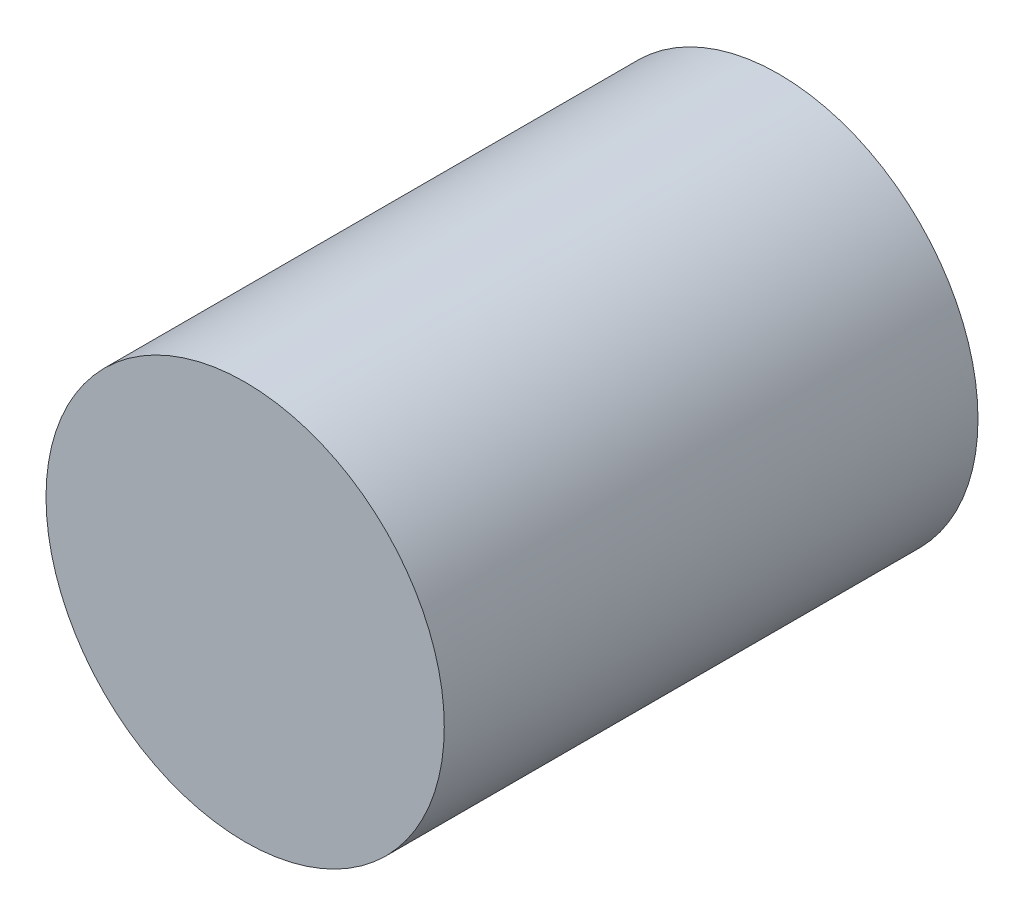
ISO-10303-21;
HEADER;
FILE_DESCRIPTION(('STEP AP214'),'2;1');
FILE_NAME('part.step','',(''),(''),'','','');
FILE_SCHEMA(('AUTOMOTIVE_DESIGN { 1 0 10303 214 1 1 1 1 }'));
ENDSEC;
DATA;
#1=APPLICATION_CONTEXT('core data for automotive mechanical design processes');
#2=APPLICATION_PROTOCOL_DEFINITION('international standard','automotive_design',2000,#1);
#3=PRODUCT_CONTEXT('',#1,'mechanical');
#4=PRODUCT('Part','Part','',(#3));
#5=PRODUCT_RELATED_PRODUCT_CATEGORY('part','',(#4));
#6=PRODUCT_DEFINITION_FORMATION('','',#4);
#7=PRODUCT_DEFINITION_CONTEXT('part definition',#1,'design');
#8=PRODUCT_DEFINITION('design','',#6,#7);
#9=PRODUCT_DEFINITION_SHAPE('','',#8);
#10=(LENGTH_UNIT() NAMED_UNIT(*) SI_UNIT(.MILLI.,.METRE.));
#11=(NAMED_UNIT(*) PLANE_ANGLE_UNIT() SI_UNIT($,.RADIAN.));
#12=(NAMED_UNIT(*) SI_UNIT($,.STERADIAN.) SOLID_ANGLE_UNIT());
#13=UNCERTAINTY_MEASURE_WITH_UNIT(LENGTH_MEASURE(1.E-05),#10,'distance_accuracy_value','');
#14=(GEOMETRIC_REPRESENTATION_CONTEXT(3) GLOBAL_UNCERTAINTY_ASSIGNED_CONTEXT((#13)) GLOBAL_UNIT_ASSIGNED_CONTEXT((#10,
#11,#12)) REPRESENTATION_CONTEXT('',''));
#15=CARTESIAN_POINT('',(0.,0.,0.));
#16=DIRECTION('',(0.,0.,1.));
#17=DIRECTION('',(1.,0.,0.));
#18=AXIS2_PLACEMENT_3D('',#15,#16,#17);
#19=CARTESIAN_POINT('',(0.,0.,0.8039989));
#20=DIRECTION('',(0.,0.,1.));
#21=DIRECTION('',(1.,0.,0.));
#22=AXIS2_PLACEMENT_3D('',#19,#20,#21);
#23=PLANE('',#22);
#24=CARTESIAN_POINT('',(0.,0.,0.8039989));
#25=DIRECTION('',(0.,0.,1.));
#26=DIRECTION('',(1.,0.,0.));
#27=AXIS2_PLACEMENT_3D('',#24,#25,#26);
#28=CIRCLE('',#27,0.2999994);
#29=CARTESIAN_POINT('',(-0.2999994,0.,0.8039989));
#30=VERTEX_POINT('',#29);
#31=EDGE_CURVE('E11',#30,#30,#28,.T.);
#32=ORIENTED_EDGE('',*,*,#31,.T.);
#33=EDGE_LOOP('',(#32));
#34=FACE_BOUND('',#33,.T.);
#35=ADVANCED_FACE('F16',(#34),#23,.T.);
#36=CARTESIAN_POINT('',(0.,0.,0.));
#37=DIRECTION('',(0.,0.,1.));
#38=DIRECTION('',(1.,0.,0.));
#39=AXIS2_PLACEMENT_3D('',#36,#37,#38);
#40=PLANE('',#39);
#41=CARTESIAN_POINT('',(0.,0.,0.));
#42=DIRECTION('',(0.,0.,1.));
#43=DIRECTION('',(1.,0.,0.));
#44=AXIS2_PLACEMENT_3D('',#41,#42,#43);
#45=CIRCLE('',#44,0.2999994);
#46=CARTESIAN_POINT('',(-0.2999994,0.,0.));
#47=VERTEX_POINT('',#46);
#48=EDGE_CURVE('E20',#47,#47,#45,.T.);
#49=ORIENTED_EDGE('',*,*,#48,.F.);
#50=EDGE_LOOP('',(#49));
#51=FACE_BOUND('',#50,.T.);
#52=ADVANCED_FACE('F18',(#51),#40,.F.);
#53=CARTESIAN_POINT('',(0.,0.,0.));
#54=DIRECTION('',(0.,0.,-1.));
#55=DIRECTION('',(1.,0.,0.));
#56=AXIS2_PLACEMENT_3D('',#53,#54,#55);
#57=CYLINDRICAL_SURFACE('',#56,0.2999994);
#58=ORIENTED_EDGE('',*,*,#48,.T.);
#59=DIRECTION('',(0.,0.,1.));
#60=VECTOR('',#59,1.);
#61=CARTESIAN_POINT('',(-0.2999994,0.,0.));
#62=LINE('',#61,#60);
#63=EDGE_CURVE('E26',#47,#30,#62,.T.);
#64=ORIENTED_EDGE('',*,*,#63,.T.);
#65=ORIENTED_EDGE('',*,*,#31,.F.);
#66=ORIENTED_EDGE('',*,*,#63,.F.);
#67=EDGE_LOOP('',(#58,#64,#65,#66));
#68=FACE_BOUND('',#67,.T.);
#69=ADVANCED_FACE('F41',(#68),#57,.T.);
#70=CLOSED_SHELL('',(#35,#52,#69));
#71=MANIFOLD_SOLID_BREP('B1',#70);
#72=ADVANCED_BREP_SHAPE_REPRESENTATION('',(#18,#71),#14);
#73=SHAPE_DEFINITION_REPRESENTATION(#9,#72);
ENDSEC;
END-ISO-10303-21;
